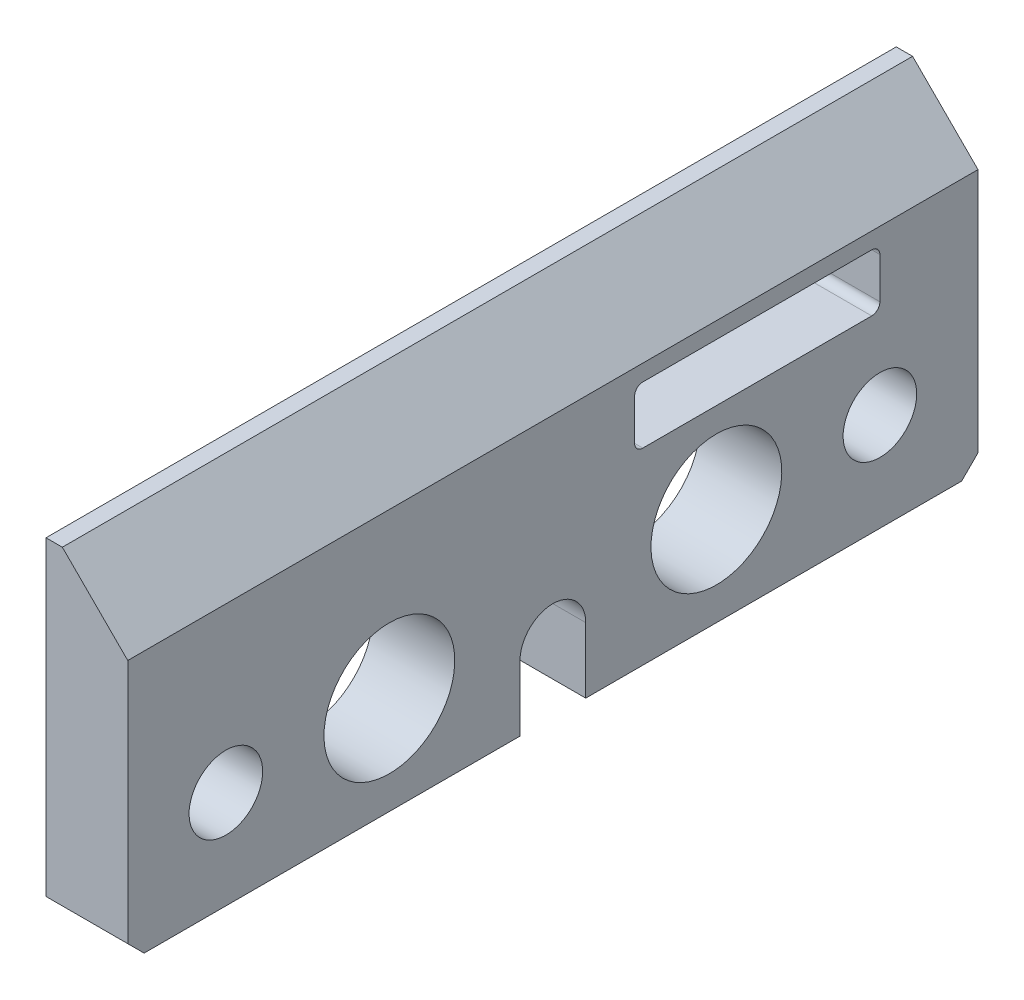
ISO-10303-21;
HEADER;
FILE_DESCRIPTION(('STEP AP214'),'2;1');
FILE_NAME('part.step','',(''),(''),'','','');
FILE_SCHEMA(('AUTOMOTIVE_DESIGN { 1 0 10303 214 1 1 1 1 }'));
ENDSEC;
DATA;
#1=APPLICATION_CONTEXT('core data for automotive mechanical design processes');
#2=APPLICATION_PROTOCOL_DEFINITION('international standard','automotive_design',2000,#1);
#3=PRODUCT_CONTEXT('',#1,'mechanical');
#4=PRODUCT('Part','Part','',(#3));
#5=PRODUCT_RELATED_PRODUCT_CATEGORY('part','',(#4));
#6=PRODUCT_DEFINITION_FORMATION('','',#4);
#7=PRODUCT_DEFINITION_CONTEXT('part definition',#1,'design');
#8=PRODUCT_DEFINITION('design','',#6,#7);
#9=PRODUCT_DEFINITION_SHAPE('','',#8);
#10=(LENGTH_UNIT() NAMED_UNIT(*) SI_UNIT(.MILLI.,.METRE.));
#11=(NAMED_UNIT(*) PLANE_ANGLE_UNIT() SI_UNIT($,.RADIAN.));
#12=(NAMED_UNIT(*) SI_UNIT($,.STERADIAN.) SOLID_ANGLE_UNIT());
#13=UNCERTAINTY_MEASURE_WITH_UNIT(LENGTH_MEASURE(1.E-05),#10,'distance_accuracy_value','');
#14=(GEOMETRIC_REPRESENTATION_CONTEXT(3) GLOBAL_UNCERTAINTY_ASSIGNED_CONTEXT((#13)) GLOBAL_UNIT_ASSIGNED_CONTEXT((#10,
#11,#12)) REPRESENTATION_CONTEXT('',''));
#15=CARTESIAN_POINT('',(0.,0.,0.));
#16=DIRECTION('',(0.,0.,1.));
#17=DIRECTION('',(1.,0.,0.));
#18=AXIS2_PLACEMENT_3D('',#15,#16,#17);
#19=CARTESIAN_POINT('',(-0.828025477706999,-16.5764331210191,52.));
#20=DIRECTION('',(0.,1.,0.));
#21=DIRECTION('',(0.,0.,1.));
#22=AXIS2_PLACEMENT_3D('',#19,#20,#21);
#23=PLANE('',#22);
#24=DIRECTION('',(0.,0.,-1.));
#25=VECTOR('',#24,1.);
#26=CARTESIAN_POINT('',(-0.828025477706999,-16.5764331210191,52.));
#27=LINE('',#26,#25);
#28=CARTESIAN_POINT('',(-0.828025477707016,-16.5764331210191,23.99));
#29=VERTEX_POINT('',#28);
#30=CARTESIAN_POINT('',(-0.828025477706999,-16.5764331210191,1.00000000000002));
#31=VERTEX_POINT('',#30);
#32=EDGE_CURVE('E269',#29,#31,#27,.T.);
#33=ORIENTED_EDGE('',*,*,#32,.T.);
#34=DIRECTION('',(1.,0.,0.));
#35=VECTOR('',#34,1.);
#36=CARTESIAN_POINT('',(-0.828025477706999,-16.5764331210191,1.00000000000001));
#37=LINE('',#36,#35);
#38=CARTESIAN_POINT('',(4.171974522293,-16.5764331210191,1.00000000000002));
#39=VERTEX_POINT('',#38);
#40=EDGE_CURVE('E308',#31,#39,#37,.T.);
#41=ORIENTED_EDGE('',*,*,#40,.T.);
#42=DIRECTION('',(0.,0.,-1.));
#43=VECTOR('',#42,1.);
#44=CARTESIAN_POINT('',(4.171974522293,-16.5764331210191,52.));
#45=LINE('',#44,#43);
#46=CARTESIAN_POINT('',(4.171974522293,-16.5764331210191,23.99));
#47=VERTEX_POINT('',#46);
#48=EDGE_CURVE('E267',#47,#39,#45,.T.);
#49=ORIENTED_EDGE('',*,*,#48,.F.);
#50=DIRECTION('',(1.,0.,0.));
#51=VECTOR('',#50,1.);
#52=CARTESIAN_POINT('',(-47.828025477707,-16.5764331210191,23.99));
#53=LINE('',#52,#51);
#54=EDGE_CURVE('E193',#29,#47,#53,.T.);
#55=ORIENTED_EDGE('',*,*,#54,.F.);
#56=EDGE_LOOP('',(#33,#41,#49,#55));
#57=FACE_BOUND('',#56,.T.);
#58=ADVANCED_FACE('F33',(#57),#23,.F.);
#59=CARTESIAN_POINT('',(-0.828025477707002,3.4235668789809,52.));
#60=DIRECTION('',(1.,0.,0.));
#61=DIRECTION('',(0.,1.,0.));
#62=AXIS2_PLACEMENT_3D('',#59,#60,#61);
#63=PLANE('',#62);
#64=CARTESIAN_POINT('',(-0.828025477707002,-10.5764331210191,6.));
#65=DIRECTION('',(1.,0.,0.));
#66=DIRECTION('',(0.,1.,0.));
#67=AXIS2_PLACEMENT_3D('',#64,#65,#66);
#68=CIRCLE('',#67,2.25);
#69=CARTESIAN_POINT('',(-0.828025477707002,-8.32643312101911,6.));
#70=VERTEX_POINT('',#69);
#71=EDGE_CURVE('E241',#70,#70,#68,.T.);
#72=ORIENTED_EDGE('',*,*,#71,.T.);
#73=EDGE_LOOP('',(#72));
#74=FACE_BOUND('',#73,.T.);
#75=DIRECTION('',(0.,-1.,0.));
#76=VECTOR('',#75,1.);
#77=CARTESIAN_POINT('',(-0.828025477707002,3.4235668789809,0.));
#78=LINE('',#77,#76);
#79=CARTESIAN_POINT('',(-0.828025477707002,3.4235668789809,0.));
#80=VERTEX_POINT('',#79);
#81=CARTESIAN_POINT('',(-0.828025477706999,-15.5764331210191,0.));
#82=VERTEX_POINT('',#81);
#83=EDGE_CURVE('E250',#80,#82,#78,.T.);
#84=ORIENTED_EDGE('',*,*,#83,.T.);
#85=DIRECTION('',(0.,0.70710678118655,-0.707106781186545));
#86=VECTOR('',#85,1.);
#87=CARTESIAN_POINT('',(-0.828025477706999,-16.5764331210191,1.00000000000001));
#88=LINE('',#87,#86);
#89=EDGE_CURVE('E319',#82,#31,#88,.F.);
#90=ORIENTED_EDGE('',*,*,#89,.T.);
#91=ORIENTED_EDGE('',*,*,#32,.F.);
#92=DIRECTION('',(0.,1.,0.));
#93=VECTOR('',#92,1.);
#94=CARTESIAN_POINT('',(-0.828025477707002,3.42356687898092,23.99));
#95=LINE('',#94,#93);
#96=CARTESIAN_POINT('',(-0.828025477707016,-12.5764331210191,23.99));
#97=VERTEX_POINT('',#96);
#98=EDGE_CURVE('E238',#29,#97,#95,.T.);
#99=ORIENTED_EDGE('',*,*,#98,.T.);
#100=CARTESIAN_POINT('',(-0.828025477707002,-12.5764331210191,26.));
#101=DIRECTION('',(1.,0.,0.));
#102=DIRECTION('',(0.,1.,0.));
#103=AXIS2_PLACEMENT_3D('',#100,#101,#102);
#104=CIRCLE('',#103,2.01);
#105=CARTESIAN_POINT('',(-0.828025477707016,-12.5764331210191,28.01));
#106=VERTEX_POINT('',#105);
#107=EDGE_CURVE('E235',#97,#106,#104,.T.);
#108=ORIENTED_EDGE('',*,*,#107,.T.);
#109=DIRECTION('',(0.,-1.,0.));
#110=VECTOR('',#109,1.);
#111=CARTESIAN_POINT('',(-0.828025477707002,3.4235668789809,28.01));
#112=LINE('',#111,#110);
#113=CARTESIAN_POINT('',(-0.828025477707016,-16.5764331210191,28.01));
#114=VERTEX_POINT('',#113);
#115=EDGE_CURVE('E172',#106,#114,#112,.T.);
#116=ORIENTED_EDGE('',*,*,#115,.T.);
#117=CARTESIAN_POINT('',(-0.828025477706999,-16.5764331210191,51.));
#118=VERTEX_POINT('',#117);
#119=EDGE_CURVE('E270',#118,#114,#27,.T.);
#120=ORIENTED_EDGE('',*,*,#119,.F.);
#121=DIRECTION('',(0.,0.707106781186545,0.70710678118655));
#122=VECTOR('',#121,1.);
#123=CARTESIAN_POINT('',(-0.828025477706999,-15.5764331210191,52.));
#124=LINE('',#123,#122);
#125=CARTESIAN_POINT('',(-0.828025477706999,-15.5764331210191,52.));
#126=VERTEX_POINT('',#125);
#127=EDGE_CURVE('E317',#118,#126,#124,.T.);
#128=ORIENTED_EDGE('',*,*,#127,.T.);
#129=DIRECTION('',(0.,-1.,0.));
#130=VECTOR('',#129,1.);
#131=CARTESIAN_POINT('',(-0.828025477707002,3.4235668789809,52.));
#132=LINE('',#131,#130);
#133=CARTESIAN_POINT('',(-0.828025477707002,3.4235668789809,52.));
#134=VERTEX_POINT('',#133);
#135=EDGE_CURVE('E251',#134,#126,#132,.T.);
#136=ORIENTED_EDGE('',*,*,#135,.F.);
#137=DIRECTION('',(0.,0.,-1.));
#138=VECTOR('',#137,1.);
#139=CARTESIAN_POINT('',(-0.828025477707002,3.4235668789809,52.));
#140=LINE('',#139,#138);
#141=EDGE_CURVE('E259',#134,#80,#140,.T.);
#142=ORIENTED_EDGE('',*,*,#141,.T.);
#143=EDGE_LOOP('',(#84,#90,#91,#99,#108,#116,#120,#128,#136,#142));
#144=FACE_BOUND('',#143,.T.);
#145=DIRECTION('',(0.,1.,0.));
#146=VECTOR('',#145,1.);
#147=CARTESIAN_POINT('',(-0.828025477707002,3.42356687898091,6.));
#148=LINE('',#147,#146);
#149=CARTESIAN_POINT('',(-0.828025477707001,-4.57643312101911,6.));
#150=VERTEX_POINT('',#149);
#151=CARTESIAN_POINT('',(-0.828025477707001,-2.07643312101911,6.));
#152=VERTEX_POINT('',#151);
#153=EDGE_CURVE('E226',#150,#152,#148,.T.);
#154=ORIENTED_EDGE('',*,*,#153,.T.);
#155=CARTESIAN_POINT('',(-0.828025477707002,-2.07643312101911,6.5));
#156=DIRECTION('',(1.,0.,0.));
#157=DIRECTION('',(0.,1.,0.));
#158=AXIS2_PLACEMENT_3D('',#155,#156,#157);
#159=CIRCLE('',#158,0.5);
#160=CARTESIAN_POINT('',(-0.828025477707001,-1.57643312101911,6.5));
#161=VERTEX_POINT('',#160);
#162=EDGE_CURVE('E298',#152,#161,#159,.T.);
#163=ORIENTED_EDGE('',*,*,#162,.T.);
#164=DIRECTION('',(0.,0.,1.));
#165=VECTOR('',#164,1.);
#166=CARTESIAN_POINT('',(-0.828025477707001,-1.57643312101914,52.));
#167=LINE('',#166,#165);
#168=CARTESIAN_POINT('',(-0.828025477707001,-1.57643312101911,20.5));
#169=VERTEX_POINT('',#168);
#170=EDGE_CURVE('E229',#161,#169,#167,.T.);
#171=ORIENTED_EDGE('',*,*,#170,.T.);
#172=CARTESIAN_POINT('',(-0.828025477707002,-2.07643312101912,20.5));
#173=DIRECTION('',(1.,0.,0.));
#174=DIRECTION('',(0.,1.,0.));
#175=AXIS2_PLACEMENT_3D('',#172,#173,#174);
#176=CIRCLE('',#175,0.5);
#177=CARTESIAN_POINT('',(-0.828025477707001,-2.07643312101912,21.));
#178=VERTEX_POINT('',#177);
#179=EDGE_CURVE('E306',#169,#178,#176,.T.);
#180=ORIENTED_EDGE('',*,*,#179,.T.);
#181=DIRECTION('',(0.,-1.,0.));
#182=VECTOR('',#181,1.);
#183=CARTESIAN_POINT('',(-0.828025477707002,3.4235668789809,21.));
#184=LINE('',#183,#182);
#185=CARTESIAN_POINT('',(-0.828025477707001,-4.57643312101911,21.));
#186=VERTEX_POINT('',#185);
#187=EDGE_CURVE('E232',#178,#186,#184,.T.);
#188=ORIENTED_EDGE('',*,*,#187,.T.);
#189=CARTESIAN_POINT('',(-0.828025477707002,-4.57643312101911,20.5));
#190=DIRECTION('',(1.,0.,0.));
#191=DIRECTION('',(0.,1.,0.));
#192=AXIS2_PLACEMENT_3D('',#189,#190,#191);
#193=CIRCLE('',#192,0.5);
#194=CARTESIAN_POINT('',(-0.828025477707,-5.0764331210191,20.5));
#195=VERTEX_POINT('',#194);
#196=EDGE_CURVE('E302',#186,#195,#193,.T.);
#197=ORIENTED_EDGE('',*,*,#196,.T.);
#198=DIRECTION('',(0.,0.,-1.));
#199=VECTOR('',#198,1.);
#200=CARTESIAN_POINT('',(-0.828025477707,-5.0764331210191,52.));
#201=LINE('',#200,#199);
#202=CARTESIAN_POINT('',(-0.828025477707,-5.0764331210191,6.5));
#203=VERTEX_POINT('',#202);
#204=EDGE_CURVE('E223',#195,#203,#201,.T.);
#205=ORIENTED_EDGE('',*,*,#204,.T.);
#206=CARTESIAN_POINT('',(-0.828025477707002,-4.57643312101911,6.5));
#207=DIRECTION('',(1.,0.,0.));
#208=DIRECTION('',(0.,1.,0.));
#209=AXIS2_PLACEMENT_3D('',#206,#207,#208);
#210=CIRCLE('',#209,0.5);
#211=EDGE_CURVE('E294',#203,#150,#210,.T.);
#212=ORIENTED_EDGE('',*,*,#211,.T.);
#213=EDGE_LOOP('',(#154,#163,#171,#180,#188,#197,#205,#212));
#214=FACE_BOUND('',#213,.T.);
#215=CARTESIAN_POINT('',(-0.828025477707002,-10.5764331210191,16.));
#216=DIRECTION('',(1.,0.,0.));
#217=DIRECTION('',(0.,1.,0.));
#218=AXIS2_PLACEMENT_3D('',#215,#216,#217);
#219=CIRCLE('',#218,4.);
#220=CARTESIAN_POINT('',(-0.828025477707003,-6.5764331210191,16.));
#221=VERTEX_POINT('',#220);
#222=EDGE_CURVE('E220',#221,#221,#219,.T.);
#223=ORIENTED_EDGE('',*,*,#222,.T.);
#224=EDGE_LOOP('',(#223));
#225=FACE_BOUND('',#224,.T.);
#226=CARTESIAN_POINT('',(-0.828025477707002,-10.5764331210191,36.));
#227=DIRECTION('',(1.,0.,0.));
#228=DIRECTION('',(0.,1.,0.));
#229=AXIS2_PLACEMENT_3D('',#226,#227,#228);
#230=CIRCLE('',#229,4.);
#231=CARTESIAN_POINT('',(-0.828025477707003,-6.57643312101911,36.));
#232=VERTEX_POINT('',#231);
#233=EDGE_CURVE('E215',#232,#232,#230,.T.);
#234=ORIENTED_EDGE('',*,*,#233,.T.);
#235=EDGE_LOOP('',(#234));
#236=FACE_BOUND('',#235,.T.);
#237=CARTESIAN_POINT('',(-0.828025477707002,-10.5764331210191,46.));
#238=DIRECTION('',(1.,0.,0.));
#239=DIRECTION('',(0.,1.,0.));
#240=AXIS2_PLACEMENT_3D('',#237,#238,#239);
#241=CIRCLE('',#240,2.25);
#242=CARTESIAN_POINT('',(-0.828025477707002,-8.3264331210191,46.));
#243=VERTEX_POINT('',#242);
#244=EDGE_CURVE('E247',#243,#243,#241,.T.);
#245=ORIENTED_EDGE('',*,*,#244,.T.);
#246=EDGE_LOOP('',(#245));
#247=FACE_BOUND('',#246,.T.);
#248=ADVANCED_FACE('F341',(#74,#144,#214,#225,#236,#247),#63,.F.);
#249=CARTESIAN_POINT('',(4.171974522293,-16.5764331210191,51.));
#250=VERTEX_POINT('',#249);
#251=CARTESIAN_POINT('',(4.171974522293,-16.5764331210191,28.01));
#252=VERTEX_POINT('',#251);
#253=EDGE_CURVE('E188',#250,#252,#45,.T.);
#254=ORIENTED_EDGE('',*,*,#253,.F.);
#255=DIRECTION('',(-1.,0.,0.));
#256=VECTOR('',#255,1.);
#257=CARTESIAN_POINT('',(-0.828025477706999,-16.5764331210191,51.));
#258=LINE('',#257,#256);
#259=EDGE_CURVE('E324',#250,#118,#258,.T.);
#260=ORIENTED_EDGE('',*,*,#259,.T.);
#261=ORIENTED_EDGE('',*,*,#119,.T.);
#262=DIRECTION('',(1.,0.,0.));
#263=VECTOR('',#262,1.);
#264=CARTESIAN_POINT('',(-47.828025477707,-16.5764331210191,28.01));
#265=LINE('',#264,#263);
#266=EDGE_CURVE('E175',#114,#252,#265,.T.);
#267=ORIENTED_EDGE('',*,*,#266,.T.);
#268=EDGE_LOOP('',(#254,#260,#261,#267));
#269=FACE_BOUND('',#268,.T.);
#270=ADVANCED_FACE('F364',(#269),#23,.F.);
#271=CARTESIAN_POINT('',(4.171974522293,3.4235668789809,52.));
#272=DIRECTION('',(-1.,0.,0.));
#273=DIRECTION('',(0.,-1.,0.));
#274=AXIS2_PLACEMENT_3D('',#271,#272,#273);
#275=PLANE('',#274);
#276=CARTESIAN_POINT('',(4.171974522293,-10.5764331210191,6.));
#277=DIRECTION('',(1.,0.,0.));
#278=DIRECTION('',(0.,1.,0.));
#279=AXIS2_PLACEMENT_3D('',#276,#277,#278);
#280=CIRCLE('',#279,2.25);
#281=CARTESIAN_POINT('',(4.171974522293,-8.32643312101911,6.));
#282=VERTEX_POINT('',#281);
#283=EDGE_CURVE('E195',#282,#282,#280,.T.);
#284=ORIENTED_EDGE('',*,*,#283,.F.);
#285=EDGE_LOOP('',(#284));
#286=FACE_BOUND('',#285,.T.);
#287=DIRECTION('',(0.,0.,-1.));
#288=VECTOR('',#287,1.);
#289=CARTESIAN_POINT('',(4.171974522293,-5.07643312101911,21.));
#290=LINE('',#289,#288);
#291=CARTESIAN_POINT('',(4.171974522293,-5.07643312101911,20.5));
#292=VERTEX_POINT('',#291);
#293=CARTESIAN_POINT('',(4.171974522293,-5.07643312101911,6.5));
#294=VERTEX_POINT('',#293);
#295=EDGE_CURVE('E200',#292,#294,#290,.T.);
#296=ORIENTED_EDGE('',*,*,#295,.F.);
#297=CARTESIAN_POINT('',(4.171974522293,-4.57643312101911,20.5));
#298=DIRECTION('',(-1.,0.,0.));
#299=DIRECTION('',(0.,-1.,0.));
#300=AXIS2_PLACEMENT_3D('',#297,#298,#299);
#301=CIRCLE('',#300,0.5);
#302=CARTESIAN_POINT('',(4.171974522293,-4.57643312101911,21.));
#303=VERTEX_POINT('',#302);
#304=EDGE_CURVE('E300',#292,#303,#301,.T.);
#305=ORIENTED_EDGE('',*,*,#304,.T.);
#306=DIRECTION('',(0.,-1.,0.));
#307=VECTOR('',#306,1.);
#308=CARTESIAN_POINT('',(4.171974522293,-1.57643312101912,21.));
#309=LINE('',#308,#307);
#310=CARTESIAN_POINT('',(4.171974522293,-2.07643312101911,21.));
#311=VERTEX_POINT('',#310);
#312=EDGE_CURVE('E197',#311,#303,#309,.T.);
#313=ORIENTED_EDGE('',*,*,#312,.F.);
#314=CARTESIAN_POINT('',(4.171974522293,-2.07643312101911,20.5));
#315=DIRECTION('',(-1.,0.,0.));
#316=DIRECTION('',(0.,-1.,0.));
#317=AXIS2_PLACEMENT_3D('',#314,#315,#316);
#318=CIRCLE('',#317,0.5);
#319=CARTESIAN_POINT('',(4.171974522293,-1.57643312101911,20.5));
#320=VERTEX_POINT('',#319);
#321=EDGE_CURVE('E304',#311,#320,#318,.T.);
#322=ORIENTED_EDGE('',*,*,#321,.T.);
#323=DIRECTION('',(0.,0.,1.));
#324=VECTOR('',#323,1.);
#325=CARTESIAN_POINT('',(4.171974522293,-1.57643312101912,21.));
#326=LINE('',#325,#324);
#327=CARTESIAN_POINT('',(4.171974522293,-1.57643312101911,6.5));
#328=VERTEX_POINT('',#327);
#329=EDGE_CURVE('E206',#328,#320,#326,.T.);
#330=ORIENTED_EDGE('',*,*,#329,.F.);
#331=CARTESIAN_POINT('',(4.171974522293,-2.07643312101911,6.5));
#332=DIRECTION('',(-1.,0.,0.));
#333=DIRECTION('',(0.,-1.,0.));
#334=AXIS2_PLACEMENT_3D('',#331,#332,#333);
#335=CIRCLE('',#334,0.5);
#336=CARTESIAN_POINT('',(4.171974522293,-2.07643312101911,6.));
#337=VERTEX_POINT('',#336);
#338=EDGE_CURVE('E296',#328,#337,#335,.T.);
#339=ORIENTED_EDGE('',*,*,#338,.T.);
#340=DIRECTION('',(0.,1.,0.));
#341=VECTOR('',#340,1.);
#342=CARTESIAN_POINT('',(4.171974522293,-1.57643312101911,6.));
#343=LINE('',#342,#341);
#344=CARTESIAN_POINT('',(4.171974522293,-4.5764331210191,6.));
#345=VERTEX_POINT('',#344);
#346=EDGE_CURVE('E203',#345,#337,#343,.T.);
#347=ORIENTED_EDGE('',*,*,#346,.F.);
#348=CARTESIAN_POINT('',(4.171974522293,-4.57643312101911,6.5));
#349=DIRECTION('',(-1.,0.,0.));
#350=DIRECTION('',(0.,-1.,0.));
#351=AXIS2_PLACEMENT_3D('',#348,#349,#350);
#352=CIRCLE('',#351,0.5);
#353=EDGE_CURVE('E292',#345,#294,#352,.T.);
#354=ORIENTED_EDGE('',*,*,#353,.T.);
#355=EDGE_LOOP('',(#296,#305,#313,#322,#330,#339,#347,#354));
#356=FACE_BOUND('',#355,.T.);
#357=CARTESIAN_POINT('',(4.171974522293,-10.5764331210191,16.));
#358=DIRECTION('',(1.,0.,0.));
#359=DIRECTION('',(0.,1.,0.));
#360=AXIS2_PLACEMENT_3D('',#357,#358,#359);
#361=CIRCLE('',#360,4.);
#362=CARTESIAN_POINT('',(4.171974522293,-6.5764331210191,16.));
#363=VERTEX_POINT('',#362);
#364=EDGE_CURVE('E211',#363,#363,#361,.T.);
#365=ORIENTED_EDGE('',*,*,#364,.F.);
#366=EDGE_LOOP('',(#365));
#367=FACE_BOUND('',#366,.T.);
#368=CARTESIAN_POINT('',(4.171974522293,-10.5764331210191,36.));
#369=DIRECTION('',(1.,0.,0.));
#370=DIRECTION('',(0.,1.,0.));
#371=AXIS2_PLACEMENT_3D('',#368,#369,#370);
#372=CIRCLE('',#371,4.);
#373=CARTESIAN_POINT('',(4.171974522293,-6.57643312101911,36.));
#374=VERTEX_POINT('',#373);
#375=EDGE_CURVE('E212',#374,#374,#372,.T.);
#376=ORIENTED_EDGE('',*,*,#375,.F.);
#377=EDGE_LOOP('',(#376));
#378=FACE_BOUND('',#377,.T.);
#379=CARTESIAN_POINT('',(4.171974522293,-10.5764331210191,46.));
#380=DIRECTION('',(1.,0.,0.));
#381=DIRECTION('',(0.,1.,0.));
#382=AXIS2_PLACEMENT_3D('',#379,#380,#381);
#383=CIRCLE('',#382,2.25);
#384=CARTESIAN_POINT('',(4.171974522293,-8.3264331210191,46.));
#385=VERTEX_POINT('',#384);
#386=EDGE_CURVE('E244',#385,#385,#383,.T.);
#387=ORIENTED_EDGE('',*,*,#386,.F.);
#388=EDGE_LOOP('',(#387));
#389=FACE_BOUND('',#388,.T.);
#390=DIRECTION('',(0.,1.,0.));
#391=VECTOR('',#390,1.);
#392=CARTESIAN_POINT('',(4.171974522293,3.4235668789809,0.));
#393=LINE('',#392,#391);
#394=CARTESIAN_POINT('',(4.171974522293,-15.5764331210191,0.));
#395=VERTEX_POINT('',#394);
#396=CARTESIAN_POINT('',(4.171974522293,-0.576433121019119,0.));
#397=VERTEX_POINT('',#396);
#398=EDGE_CURVE('E262',#395,#397,#393,.T.);
#399=ORIENTED_EDGE('',*,*,#398,.T.);
#400=DIRECTION('',(0.,0.,1.));
#401=VECTOR('',#400,1.);
#402=CARTESIAN_POINT('',(4.171974522293,-0.576433121019119,52.));
#403=LINE('',#402,#401);
#404=CARTESIAN_POINT('',(4.171974522293,-0.576433121019119,52.));
#405=VERTEX_POINT('',#404);
#406=EDGE_CURVE('E41',#397,#405,#403,.T.);
#407=ORIENTED_EDGE('',*,*,#406,.T.);
#408=DIRECTION('',(0.,1.,0.));
#409=VECTOR('',#408,1.);
#410=CARTESIAN_POINT('',(4.171974522293,3.4235668789809,52.));
#411=LINE('',#410,#409);
#412=CARTESIAN_POINT('',(4.171974522293,-15.5764331210191,52.));
#413=VERTEX_POINT('',#412);
#414=EDGE_CURVE('E254',#413,#405,#411,.T.);
#415=ORIENTED_EDGE('',*,*,#414,.F.);
#416=DIRECTION('',(0.,-0.707106781186545,-0.70710678118655));
#417=VECTOR('',#416,1.);
#418=CARTESIAN_POINT('',(4.171974522293,-15.5764331210191,52.));
#419=LINE('',#418,#417);
#420=EDGE_CURVE('E311',#413,#250,#419,.T.);
#421=ORIENTED_EDGE('',*,*,#420,.T.);
#422=ORIENTED_EDGE('',*,*,#253,.T.);
#423=DIRECTION('',(0.,-1.,0.));
#424=VECTOR('',#423,1.);
#425=CARTESIAN_POINT('',(4.171974522293,-16.5764331210191,28.01));
#426=LINE('',#425,#424);
#427=CARTESIAN_POINT('',(4.171974522293,-12.5764331210191,28.01));
#428=VERTEX_POINT('',#427);
#429=EDGE_CURVE('E169',#428,#252,#426,.T.);
#430=ORIENTED_EDGE('',*,*,#429,.F.);
#431=CARTESIAN_POINT('',(4.171974522293,-12.5764331210191,26.));
#432=DIRECTION('',(1.,0.,0.));
#433=DIRECTION('',(0.,1.,0.));
#434=AXIS2_PLACEMENT_3D('',#431,#432,#433);
#435=CIRCLE('',#434,2.01);
#436=CARTESIAN_POINT('',(4.171974522293,-12.5764331210191,23.99));
#437=VERTEX_POINT('',#436);
#438=EDGE_CURVE('E180',#437,#428,#435,.T.);
#439=ORIENTED_EDGE('',*,*,#438,.F.);
#440=DIRECTION('',(0.,1.,0.));
#441=VECTOR('',#440,1.);
#442=CARTESIAN_POINT('',(4.171974522293,-16.5764331210191,23.99));
#443=LINE('',#442,#441);
#444=EDGE_CURVE('E184',#47,#437,#443,.T.);
#445=ORIENTED_EDGE('',*,*,#444,.F.);
#446=ORIENTED_EDGE('',*,*,#48,.T.);
#447=DIRECTION('',(0.,-0.70710678118655,0.707106781186545));
#448=VECTOR('',#447,1.);
#449=CARTESIAN_POINT('',(4.171974522293,-16.5764331210191,1.00000000000001));
#450=LINE('',#449,#448);
#451=EDGE_CURVE('E313',#39,#395,#450,.F.);
#452=ORIENTED_EDGE('',*,*,#451,.T.);
#453=EDGE_LOOP('',(#399,#407,#415,#421,#422,#430,#439,#445,#446,#452));
#454=FACE_BOUND('',#453,.T.);
#455=ADVANCED_FACE('F186',(#286,#356,#367,#378,#389,#454),#275,.F.);
#456=CARTESIAN_POINT('',(-0.828025477707002,3.4235668789809,52.));
#457=DIRECTION('',(0.,-1.,0.));
#458=DIRECTION('',(0.,0.,-1.));
#459=AXIS2_PLACEMENT_3D('',#456,#457,#458);
#460=PLANE('',#459);
#461=DIRECTION('',(-1.,0.,0.));
#462=VECTOR('',#461,1.);
#463=CARTESIAN_POINT('',(-0.828025477707002,3.4235668789809,52.));
#464=LINE('',#463,#462);
#465=CARTESIAN_POINT('',(0.171974522292999,3.4235668789809,52.));
#466=VERTEX_POINT('',#465);
#467=EDGE_CURVE('E257',#466,#134,#464,.T.);
#468=ORIENTED_EDGE('',*,*,#467,.F.);
#469=DIRECTION('',(0.,0.,-1.));
#470=VECTOR('',#469,1.);
#471=CARTESIAN_POINT('',(0.171974522292999,3.4235668789809,52.));
#472=LINE('',#471,#470);
#473=CARTESIAN_POINT('',(0.171974522292999,3.4235668789809,0.));
#474=VERTEX_POINT('',#473);
#475=EDGE_CURVE('E326',#466,#474,#472,.T.);
#476=ORIENTED_EDGE('',*,*,#475,.T.);
#477=DIRECTION('',(-1.,0.,0.));
#478=VECTOR('',#477,1.);
#479=CARTESIAN_POINT('',(-0.828025477707002,3.4235668789809,0.));
#480=LINE('',#479,#478);
#481=EDGE_CURVE('E255',#474,#80,#480,.T.);
#482=ORIENTED_EDGE('',*,*,#481,.T.);
#483=ORIENTED_EDGE('',*,*,#141,.F.);
#484=EDGE_LOOP('',(#468,#476,#482,#483));
#485=FACE_BOUND('',#484,.T.);
#486=ADVANCED_FACE('F332',(#485),#460,.F.);
#487=CARTESIAN_POINT('',(0.,0.,52.));
#488=DIRECTION('',(0.,0.,1.));
#489=DIRECTION('',(1.,0.,0.));
#490=AXIS2_PLACEMENT_3D('',#487,#488,#489);
#491=PLANE('',#490);
#492=ORIENTED_EDGE('',*,*,#414,.T.);
#493=DIRECTION('',(0.707106781186546,-0.707106781186549,0.));
#494=VECTOR('',#493,1.);
#495=CARTESIAN_POINT('',(1.79777070063695,1.79777070063694,52.));
#496=LINE('',#495,#494);
#497=EDGE_CURVE('E11',#405,#466,#496,.F.);
#498=ORIENTED_EDGE('',*,*,#497,.T.);
#499=ORIENTED_EDGE('',*,*,#467,.T.);
#500=ORIENTED_EDGE('',*,*,#135,.T.);
#501=DIRECTION('',(1.,0.,0.));
#502=VECTOR('',#501,1.);
#503=CARTESIAN_POINT('',(4.171974522293,-15.5764331210191,52.));
#504=LINE('',#503,#502);
#505=EDGE_CURVE('E321',#126,#413,#504,.T.);
#506=ORIENTED_EDGE('',*,*,#505,.T.);
#507=EDGE_LOOP('',(#492,#498,#499,#500,#506));
#508=FACE_BOUND('',#507,.T.);
#509=ADVANCED_FACE('F363',(#508),#491,.T.);
#510=CARTESIAN_POINT('',(0.,0.,0.));
#511=DIRECTION('',(0.,0.,1.));
#512=DIRECTION('',(1.,0.,0.));
#513=AXIS2_PLACEMENT_3D('',#510,#511,#512);
#514=PLANE('',#513);
#515=ORIENTED_EDGE('',*,*,#481,.F.);
#516=DIRECTION('',(-0.707106781186546,0.707106781186549,0.));
#517=VECTOR('',#516,1.);
#518=CARTESIAN_POINT('',(0.171974522292999,3.4235668789809,0.));
#519=LINE('',#518,#517);
#520=EDGE_CURVE('E55',#474,#397,#519,.F.);
#521=ORIENTED_EDGE('',*,*,#520,.T.);
#522=ORIENTED_EDGE('',*,*,#398,.F.);
#523=DIRECTION('',(-1.,0.,0.));
#524=VECTOR('',#523,1.);
#525=CARTESIAN_POINT('',(0.,-15.5764331210191,0.));
#526=LINE('',#525,#524);
#527=EDGE_CURVE('E315',#395,#82,#526,.T.);
#528=ORIENTED_EDGE('',*,*,#527,.T.);
#529=ORIENTED_EDGE('',*,*,#83,.F.);
#530=EDGE_LOOP('',(#515,#521,#522,#528,#529));
#531=FACE_BOUND('',#530,.T.);
#532=ADVANCED_FACE('F337',(#531),#514,.F.);
#533=CARTESIAN_POINT('',(-47.828025477707,-10.5764331210191,46.));
#534=DIRECTION('',(1.,0.,0.));
#535=DIRECTION('',(0.,1.,0.));
#536=AXIS2_PLACEMENT_3D('',#533,#534,#535);
#537=CYLINDRICAL_SURFACE('',#536,2.25);
#538=ORIENTED_EDGE('',*,*,#386,.T.);
#539=EDGE_LOOP('',(#538));
#540=FACE_BOUND('',#539,.T.);
#541=ORIENTED_EDGE('',*,*,#244,.F.);
#542=EDGE_LOOP('',(#541));
#543=FACE_BOUND('',#542,.T.);
#544=ADVANCED_FACE('F438',(#540,#543),#537,.F.);
#545=CARTESIAN_POINT('',(-47.828025477707,-10.5764331210191,36.));
#546=DIRECTION('',(1.,0.,0.));
#547=DIRECTION('',(0.,1.,0.));
#548=AXIS2_PLACEMENT_3D('',#545,#546,#547);
#549=CYLINDRICAL_SURFACE('',#548,4.);
#550=ORIENTED_EDGE('',*,*,#375,.T.);
#551=EDGE_LOOP('',(#550));
#552=FACE_BOUND('',#551,.T.);
#553=ORIENTED_EDGE('',*,*,#233,.F.);
#554=EDGE_LOOP('',(#553));
#555=FACE_BOUND('',#554,.T.);
#556=ADVANCED_FACE('F451',(#552,#555),#549,.F.);
#557=CARTESIAN_POINT('',(-47.828025477707,-10.5764331210191,16.));
#558=DIRECTION('',(1.,0.,0.));
#559=DIRECTION('',(0.,1.,0.));
#560=AXIS2_PLACEMENT_3D('',#557,#558,#559);
#561=CYLINDRICAL_SURFACE('',#560,4.);
#562=ORIENTED_EDGE('',*,*,#364,.T.);
#563=EDGE_LOOP('',(#562));
#564=FACE_BOUND('',#563,.T.);
#565=ORIENTED_EDGE('',*,*,#222,.F.);
#566=EDGE_LOOP('',(#565));
#567=FACE_BOUND('',#566,.T.);
#568=ADVANCED_FACE('F459',(#564,#567),#561,.F.);
#569=CARTESIAN_POINT('',(-47.828025477707,-1.57643312101912,21.));
#570=DIRECTION('',(0.,0.,1.));
#571=DIRECTION('',(1.,0.,0.));
#572=AXIS2_PLACEMENT_3D('',#569,#570,#571);
#573=PLANE('',#572);
#574=ORIENTED_EDGE('',*,*,#312,.T.);
#575=DIRECTION('',(1.,0.,0.));
#576=VECTOR('',#575,1.);
#577=CARTESIAN_POINT('',(-0.828025477707016,-4.57643312101911,21.));
#578=LINE('',#577,#576);
#579=EDGE_CURVE('E290',#303,#186,#578,.F.);
#580=ORIENTED_EDGE('',*,*,#579,.T.);
#581=ORIENTED_EDGE('',*,*,#187,.F.);
#582=DIRECTION('',(1.,0.,0.));
#583=VECTOR('',#582,1.);
#584=CARTESIAN_POINT('',(4.171974522293,-2.07643312101911,21.));
#585=LINE('',#584,#583);
#586=EDGE_CURVE('E287',#178,#311,#585,.T.);
#587=ORIENTED_EDGE('',*,*,#586,.T.);
#588=EDGE_LOOP('',(#574,#580,#581,#587));
#589=FACE_BOUND('',#588,.T.);
#590=ADVANCED_FACE('F467',(#589),#573,.F.);
#591=CARTESIAN_POINT('',(-47.828025477707,-1.57643312101912,21.));
#592=DIRECTION('',(0.,1.,0.));
#593=DIRECTION('',(0.,0.,1.));
#594=AXIS2_PLACEMENT_3D('',#591,#592,#593);
#595=PLANE('',#594);
#596=ORIENTED_EDGE('',*,*,#170,.F.);
#597=DIRECTION('',(1.,0.,0.));
#598=VECTOR('',#597,1.);
#599=CARTESIAN_POINT('',(4.171974522293,-1.57643312101911,6.5));
#600=LINE('',#599,#598);
#601=EDGE_CURVE('E284',#161,#328,#600,.T.);
#602=ORIENTED_EDGE('',*,*,#601,.T.);
#603=ORIENTED_EDGE('',*,*,#329,.T.);
#604=DIRECTION('',(1.,0.,0.));
#605=VECTOR('',#604,1.);
#606=CARTESIAN_POINT('',(-0.828025477707016,-1.57643312101912,20.5));
#607=LINE('',#606,#605);
#608=EDGE_CURVE('E282',#320,#169,#607,.F.);
#609=ORIENTED_EDGE('',*,*,#608,.T.);
#610=EDGE_LOOP('',(#596,#602,#603,#609));
#611=FACE_BOUND('',#610,.T.);
#612=ADVANCED_FACE('F476',(#611),#595,.F.);
#613=CARTESIAN_POINT('',(-47.828025477707,-1.57643312101911,6.));
#614=DIRECTION('',(0.,0.,-1.));
#615=DIRECTION('',(0.,1.,0.));
#616=AXIS2_PLACEMENT_3D('',#613,#614,#615);
#617=PLANE('',#616);
#618=ORIENTED_EDGE('',*,*,#153,.F.);
#619=DIRECTION('',(1.,0.,0.));
#620=VECTOR('',#619,1.);
#621=CARTESIAN_POINT('',(4.171974522293,-4.57643312101911,6.));
#622=LINE('',#621,#620);
#623=EDGE_CURVE('E274',#150,#345,#622,.T.);
#624=ORIENTED_EDGE('',*,*,#623,.T.);
#625=ORIENTED_EDGE('',*,*,#346,.T.);
#626=DIRECTION('',(1.,0.,0.));
#627=VECTOR('',#626,1.);
#628=CARTESIAN_POINT('',(-0.828025477707016,-2.07643312101911,6.));
#629=LINE('',#628,#627);
#630=EDGE_CURVE('E272',#337,#152,#629,.F.);
#631=ORIENTED_EDGE('',*,*,#630,.T.);
#632=EDGE_LOOP('',(#618,#624,#625,#631));
#633=FACE_BOUND('',#632,.T.);
#634=ADVANCED_FACE('F485',(#633),#617,.F.);
#635=CARTESIAN_POINT('',(-47.828025477707,-5.07643312101911,21.));
#636=DIRECTION('',(0.,-1.,0.));
#637=DIRECTION('',(1.,0.,0.));
#638=AXIS2_PLACEMENT_3D('',#635,#636,#637);
#639=PLANE('',#638);
#640=ORIENTED_EDGE('',*,*,#295,.T.);
#641=DIRECTION('',(1.,0.,0.));
#642=VECTOR('',#641,1.);
#643=CARTESIAN_POINT('',(-0.828025477707002,-5.07643312101911,6.5));
#644=LINE('',#643,#642);
#645=EDGE_CURVE('E280',#294,#203,#644,.F.);
#646=ORIENTED_EDGE('',*,*,#645,.T.);
#647=ORIENTED_EDGE('',*,*,#204,.F.);
#648=DIRECTION('',(1.,0.,0.));
#649=VECTOR('',#648,1.);
#650=CARTESIAN_POINT('',(4.171974522293,-5.07643312101911,20.5));
#651=LINE('',#650,#649);
#652=EDGE_CURVE('E277',#195,#292,#651,.T.);
#653=ORIENTED_EDGE('',*,*,#652,.T.);
#654=EDGE_LOOP('',(#640,#646,#647,#653));
#655=FACE_BOUND('',#654,.T.);
#656=ADVANCED_FACE('F493',(#655),#639,.F.);
#657=CARTESIAN_POINT('',(-47.828025477707,-16.5764331210191,23.99));
#658=DIRECTION('',(0.,0.,-1.));
#659=DIRECTION('',(0.,1.,0.));
#660=AXIS2_PLACEMENT_3D('',#657,#658,#659);
#661=PLANE('',#660);
#662=ORIENTED_EDGE('',*,*,#54,.T.);
#663=ORIENTED_EDGE('',*,*,#444,.T.);
#664=DIRECTION('',(1.,0.,0.));
#665=VECTOR('',#664,1.);
#666=CARTESIAN_POINT('',(-47.828025477707,-12.5764331210191,23.99));
#667=LINE('',#666,#665);
#668=EDGE_CURVE('E176',#97,#437,#667,.T.);
#669=ORIENTED_EDGE('',*,*,#668,.F.);
#670=ORIENTED_EDGE('',*,*,#98,.F.);
#671=EDGE_LOOP('',(#662,#663,#669,#670));
#672=FACE_BOUND('',#671,.T.);
#673=ADVANCED_FACE('F354',(#672),#661,.F.);
#674=CARTESIAN_POINT('',(-47.828025477707,-16.5764331210191,28.01));
#675=DIRECTION('',(0.,0.,1.));
#676=DIRECTION('',(1.,0.,0.));
#677=AXIS2_PLACEMENT_3D('',#674,#675,#676);
#678=PLANE('',#677);
#679=DIRECTION('',(1.,0.,0.));
#680=VECTOR('',#679,1.);
#681=CARTESIAN_POINT('',(-47.828025477707,-12.5764331210191,28.01));
#682=LINE('',#681,#680);
#683=EDGE_CURVE('E164',#106,#428,#682,.T.);
#684=ORIENTED_EDGE('',*,*,#683,.T.);
#685=ORIENTED_EDGE('',*,*,#429,.T.);
#686=ORIENTED_EDGE('',*,*,#266,.F.);
#687=ORIENTED_EDGE('',*,*,#115,.F.);
#688=EDGE_LOOP('',(#684,#685,#686,#687));
#689=FACE_BOUND('',#688,.T.);
#690=ADVANCED_FACE('F166',(#689),#678,.F.);
#691=CARTESIAN_POINT('',(-47.828025477707,-12.5764331210191,26.));
#692=DIRECTION('',(1.,0.,0.));
#693=DIRECTION('',(0.,1.,0.));
#694=AXIS2_PLACEMENT_3D('',#691,#692,#693);
#695=CYLINDRICAL_SURFACE('',#694,2.01);
#696=ORIENTED_EDGE('',*,*,#668,.T.);
#697=ORIENTED_EDGE('',*,*,#438,.T.);
#698=ORIENTED_EDGE('',*,*,#683,.F.);
#699=ORIENTED_EDGE('',*,*,#107,.F.);
#700=EDGE_LOOP('',(#696,#697,#698,#699));
#701=FACE_BOUND('',#700,.T.);
#702=ADVANCED_FACE('F181',(#701),#695,.F.);
#703=CARTESIAN_POINT('',(-47.828025477707,-10.5764331210191,6.));
#704=DIRECTION('',(1.,0.,0.));
#705=DIRECTION('',(0.,1.,0.));
#706=AXIS2_PLACEMENT_3D('',#703,#704,#705);
#707=CYLINDRICAL_SURFACE('',#706,2.25);
#708=ORIENTED_EDGE('',*,*,#283,.T.);
#709=EDGE_LOOP('',(#708));
#710=FACE_BOUND('',#709,.T.);
#711=ORIENTED_EDGE('',*,*,#71,.F.);
#712=EDGE_LOOP('',(#711));
#713=FACE_BOUND('',#712,.T.);
#714=ADVANCED_FACE('F520',(#710,#713),#707,.F.);
#715=CARTESIAN_POINT('',(-47.828025477707,-4.57643312101911,6.5));
#716=DIRECTION('',(-1.,0.,0.));
#717=DIRECTION('',(0.,-1.,0.));
#718=AXIS2_PLACEMENT_3D('',#715,#716,#717);
#719=CYLINDRICAL_SURFACE('',#718,0.5);
#720=ORIENTED_EDGE('',*,*,#211,.F.);
#721=ORIENTED_EDGE('',*,*,#645,.F.);
#722=ORIENTED_EDGE('',*,*,#353,.F.);
#723=ORIENTED_EDGE('',*,*,#623,.F.);
#724=EDGE_LOOP('',(#720,#721,#722,#723));
#725=FACE_BOUND('',#724,.T.);
#726=ADVANCED_FACE('F526',(#725),#719,.F.);
#727=CARTESIAN_POINT('',(-47.828025477707,-2.07643312101911,6.5));
#728=DIRECTION('',(-1.,0.,0.));
#729=DIRECTION('',(0.,-1.,0.));
#730=AXIS2_PLACEMENT_3D('',#727,#728,#729);
#731=CYLINDRICAL_SURFACE('',#730,0.5);
#732=ORIENTED_EDGE('',*,*,#162,.F.);
#733=ORIENTED_EDGE('',*,*,#630,.F.);
#734=ORIENTED_EDGE('',*,*,#338,.F.);
#735=ORIENTED_EDGE('',*,*,#601,.F.);
#736=EDGE_LOOP('',(#732,#733,#734,#735));
#737=FACE_BOUND('',#736,.T.);
#738=ADVANCED_FACE('F533',(#737),#731,.F.);
#739=CARTESIAN_POINT('',(-47.828025477707,-4.57643312101911,20.5));
#740=DIRECTION('',(-1.,0.,0.));
#741=DIRECTION('',(0.,-1.,0.));
#742=AXIS2_PLACEMENT_3D('',#739,#740,#741);
#743=CYLINDRICAL_SURFACE('',#742,0.5);
#744=ORIENTED_EDGE('',*,*,#196,.F.);
#745=ORIENTED_EDGE('',*,*,#579,.F.);
#746=ORIENTED_EDGE('',*,*,#304,.F.);
#747=ORIENTED_EDGE('',*,*,#652,.F.);
#748=EDGE_LOOP('',(#744,#745,#746,#747));
#749=FACE_BOUND('',#748,.T.);
#750=ADVANCED_FACE('F541',(#749),#743,.F.);
#751=CARTESIAN_POINT('',(-47.828025477707,-2.07643312101912,20.5));
#752=DIRECTION('',(-1.,0.,0.));
#753=DIRECTION('',(0.,-1.,0.));
#754=AXIS2_PLACEMENT_3D('',#751,#752,#753);
#755=CYLINDRICAL_SURFACE('',#754,0.5);
#756=ORIENTED_EDGE('',*,*,#179,.F.);
#757=ORIENTED_EDGE('',*,*,#608,.F.);
#758=ORIENTED_EDGE('',*,*,#321,.F.);
#759=ORIENTED_EDGE('',*,*,#586,.F.);
#760=EDGE_LOOP('',(#756,#757,#758,#759));
#761=FACE_BOUND('',#760,.T.);
#762=ADVANCED_FACE('F397',(#761),#755,.F.);
#763=CARTESIAN_POINT('',(-0.828025477706999,-16.5764331210191,1.00000000000001));
#764=DIRECTION('',(0.,0.707106781186545,0.70710678118655));
#765=DIRECTION('',(1.,0.,0.));
#766=AXIS2_PLACEMENT_3D('',#763,#764,#765);
#767=PLANE('',#766);
#768=ORIENTED_EDGE('',*,*,#89,.F.);
#769=ORIENTED_EDGE('',*,*,#527,.F.);
#770=ORIENTED_EDGE('',*,*,#451,.F.);
#771=ORIENTED_EDGE('',*,*,#40,.F.);
#772=EDGE_LOOP('',(#768,#769,#770,#771));
#773=FACE_BOUND('',#772,.T.);
#774=ADVANCED_FACE('F348',(#773),#767,.F.);
#775=CARTESIAN_POINT('',(0.,-15.5764331210191,52.));
#776=DIRECTION('',(0.,-0.70710678118655,0.707106781186545));
#777=DIRECTION('',(-1.,0.,0.));
#778=AXIS2_PLACEMENT_3D('',#775,#776,#777);
#779=PLANE('',#778);
#780=ORIENTED_EDGE('',*,*,#127,.F.);
#781=ORIENTED_EDGE('',*,*,#259,.F.);
#782=ORIENTED_EDGE('',*,*,#420,.F.);
#783=ORIENTED_EDGE('',*,*,#505,.F.);
#784=EDGE_LOOP('',(#780,#781,#782,#783));
#785=FACE_BOUND('',#784,.T.);
#786=ADVANCED_FACE('F361',(#785),#779,.T.);
#787=CARTESIAN_POINT('',(0.171974522292999,3.4235668789809,52.));
#788=DIRECTION('',(-0.707106781186549,-0.707106781186546,0.));
#789=DIRECTION('',(0.,0.,-1.));
#790=AXIS2_PLACEMENT_3D('',#787,#788,#789);
#791=PLANE('',#790);
#792=ORIENTED_EDGE('',*,*,#497,.F.);
#793=ORIENTED_EDGE('',*,*,#406,.F.);
#794=ORIENTED_EDGE('',*,*,#520,.F.);
#795=ORIENTED_EDGE('',*,*,#475,.F.);
#796=EDGE_LOOP('',(#792,#793,#794,#795));
#797=FACE_BOUND('',#796,.T.);
#798=ADVANCED_FACE('F35',(#797),#791,.F.);
#799=CLOSED_SHELL('',(#58,#248,#270,#455,#486,#509,#532,#544,#556,#568,#590,#612,#634,#656,#673,
#690,#702,#714,#726,#738,#750,#762,#774,#786,#798));
#800=MANIFOLD_SOLID_BREP('B2',#799);
#801=ADVANCED_BREP_SHAPE_REPRESENTATION('',(#18,#800),#14);
#802=SHAPE_DEFINITION_REPRESENTATION(#9,#801);
ENDSEC;
END-ISO-10303-21;
